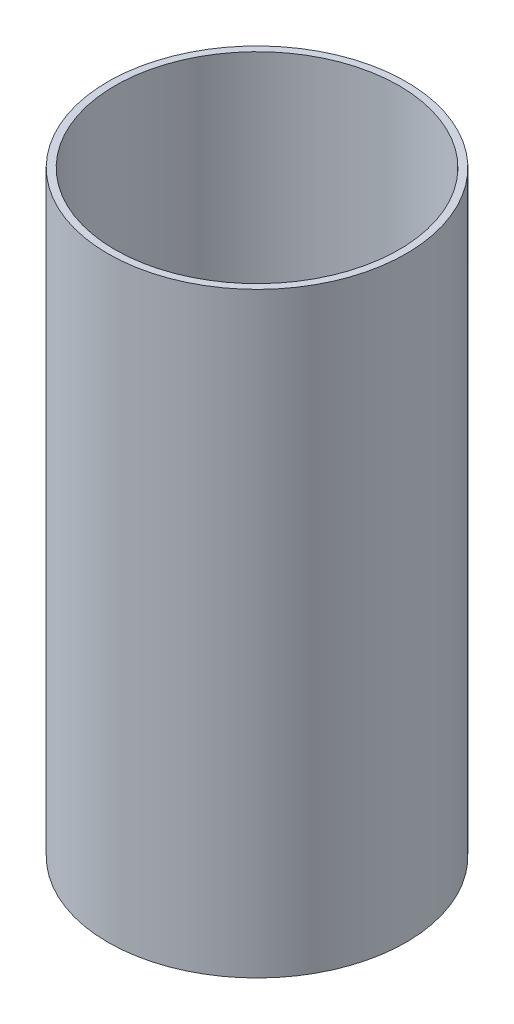
ISO-10303-21;
HEADER;
FILE_DESCRIPTION(('STEP AP214'),'2;1');
FILE_NAME('part.step','',(''),(''),'','','');
FILE_SCHEMA(('AUTOMOTIVE_DESIGN { 1 0 10303 214 1 1 1 1 }'));
ENDSEC;
DATA;
#1=APPLICATION_CONTEXT('core data for automotive mechanical design processes');
#2=APPLICATION_PROTOCOL_DEFINITION('international standard','automotive_design',2000,#1);
#3=PRODUCT_CONTEXT('',#1,'mechanical');
#4=PRODUCT('Part','Part','',(#3));
#5=PRODUCT_RELATED_PRODUCT_CATEGORY('part','',(#4));
#6=PRODUCT_DEFINITION_FORMATION('','',#4);
#7=PRODUCT_DEFINITION_CONTEXT('part definition',#1,'design');
#8=PRODUCT_DEFINITION('design','',#6,#7);
#9=PRODUCT_DEFINITION_SHAPE('','',#8);
#10=(LENGTH_UNIT() NAMED_UNIT(*) SI_UNIT(.MILLI.,.METRE.));
#11=(NAMED_UNIT(*) PLANE_ANGLE_UNIT() SI_UNIT($,.RADIAN.));
#12=(NAMED_UNIT(*) SI_UNIT($,.STERADIAN.) SOLID_ANGLE_UNIT());
#13=UNCERTAINTY_MEASURE_WITH_UNIT(LENGTH_MEASURE(1.E-05),#10,'distance_accuracy_value','');
#14=(GEOMETRIC_REPRESENTATION_CONTEXT(3) GLOBAL_UNCERTAINTY_ASSIGNED_CONTEXT((#13)) GLOBAL_UNIT_ASSIGNED_CONTEXT((#10,
#11,#12)) REPRESENTATION_CONTEXT('',''));
#15=CARTESIAN_POINT('',(0.,0.,0.));
#16=DIRECTION('',(0.,0.,1.));
#17=DIRECTION('',(1.,0.,0.));
#18=AXIS2_PLACEMENT_3D('',#15,#16,#17);
#19=CARTESIAN_POINT('',(0.,254.,0.));
#20=DIRECTION('',(0.,1.,0.));
#21=DIRECTION('',(0.,0.,1.));
#22=AXIS2_PLACEMENT_3D('',#19,#20,#21);
#23=PLANE('',#22);
#24=CARTESIAN_POINT('',(0.,254.,0.));
#25=DIRECTION('',(0.,1.,0.));
#26=DIRECTION('',(0.,0.,1.));
#27=AXIS2_PLACEMENT_3D('',#24,#25,#26);
#28=CIRCLE('',#27,63.5);
#29=CARTESIAN_POINT('',(0.,254.,63.5));
#30=VERTEX_POINT('',#29);
#31=EDGE_CURVE('E10',#30,#30,#28,.T.);
#32=ORIENTED_EDGE('',*,*,#31,.T.);
#33=EDGE_LOOP('',(#32));
#34=FACE_BOUND('',#33,.T.);
#35=CARTESIAN_POINT('',(0.,254.,0.));
#36=DIRECTION('',(0.,1.,0.));
#37=DIRECTION('',(0.,0.,1.));
#38=AXIS2_PLACEMENT_3D('',#35,#36,#37);
#39=CIRCLE('',#38,60.5028);
#40=CARTESIAN_POINT('',(0.,254.,60.5028));
#41=VERTEX_POINT('',#40);
#42=EDGE_CURVE('E44',#41,#41,#39,.T.);
#43=ORIENTED_EDGE('',*,*,#42,.F.);
#44=EDGE_LOOP('',(#43));
#45=FACE_BOUND('',#44,.T.);
#46=ADVANCED_FACE('F33',(#34,#45),#23,.T.);
#47=CARTESIAN_POINT('',(0.,0.,0.));
#48=DIRECTION('',(0.,1.,0.));
#49=DIRECTION('',(0.,0.,1.));
#50=AXIS2_PLACEMENT_3D('',#47,#48,#49);
#51=PLANE('',#50);
#52=CARTESIAN_POINT('',(0.,0.,0.));
#53=DIRECTION('',(0.,1.,0.));
#54=DIRECTION('',(0.,0.,1.));
#55=AXIS2_PLACEMENT_3D('',#52,#53,#54);
#56=CIRCLE('',#55,63.5);
#57=CARTESIAN_POINT('',(0.,0.,63.5));
#58=VERTEX_POINT('',#57);
#59=EDGE_CURVE('E37',#58,#58,#56,.T.);
#60=ORIENTED_EDGE('',*,*,#59,.F.);
#61=EDGE_LOOP('',(#60));
#62=FACE_BOUND('',#61,.T.);
#63=CARTESIAN_POINT('',(0.,0.,0.));
#64=DIRECTION('',(0.,1.,0.));
#65=DIRECTION('',(0.,0.,1.));
#66=AXIS2_PLACEMENT_3D('',#63,#64,#65);
#67=CIRCLE('',#66,60.5028);
#68=CARTESIAN_POINT('',(0.,0.,60.5028));
#69=VERTEX_POINT('',#68);
#70=EDGE_CURVE('E46',#69,#69,#67,.T.);
#71=ORIENTED_EDGE('',*,*,#70,.T.);
#72=EDGE_LOOP('',(#71));
#73=FACE_BOUND('',#72,.T.);
#74=ADVANCED_FACE('F56',(#62,#73),#51,.F.);
#75=CARTESIAN_POINT('',(0.,254.,0.));
#76=DIRECTION('',(0.,-1.,0.));
#77=DIRECTION('',(0.,0.,-1.));
#78=AXIS2_PLACEMENT_3D('',#75,#76,#77);
#79=CYLINDRICAL_SURFACE('',#78,63.5);
#80=ORIENTED_EDGE('',*,*,#31,.F.);
#81=EDGE_LOOP('',(#80));
#82=FACE_BOUND('',#81,.T.);
#83=ORIENTED_EDGE('',*,*,#59,.T.);
#84=EDGE_LOOP('',(#83));
#85=FACE_BOUND('',#84,.T.);
#86=ADVANCED_FACE('F35',(#82,#85),#79,.T.);
#87=CARTESIAN_POINT('',(0.,254.,0.));
#88=DIRECTION('',(0.,-1.,0.));
#89=DIRECTION('',(0.,0.,-1.));
#90=AXIS2_PLACEMENT_3D('',#87,#88,#89);
#91=CYLINDRICAL_SURFACE('',#90,60.5028);
#92=ORIENTED_EDGE('',*,*,#42,.T.);
#93=EDGE_LOOP('',(#92));
#94=FACE_BOUND('',#93,.T.);
#95=ORIENTED_EDGE('',*,*,#70,.F.);
#96=EDGE_LOOP('',(#95));
#97=FACE_BOUND('',#96,.T.);
#98=ADVANCED_FACE('F52',(#94,#97),#91,.F.);
#99=CLOSED_SHELL('',(#46,#74,#86,#98));
#100=MANIFOLD_SOLID_BREP('B2',#99);
#101=ADVANCED_BREP_SHAPE_REPRESENTATION('',(#18,#100),#14);
#102=SHAPE_DEFINITION_REPRESENTATION(#9,#101);
ENDSEC;
END-ISO-10303-21;
